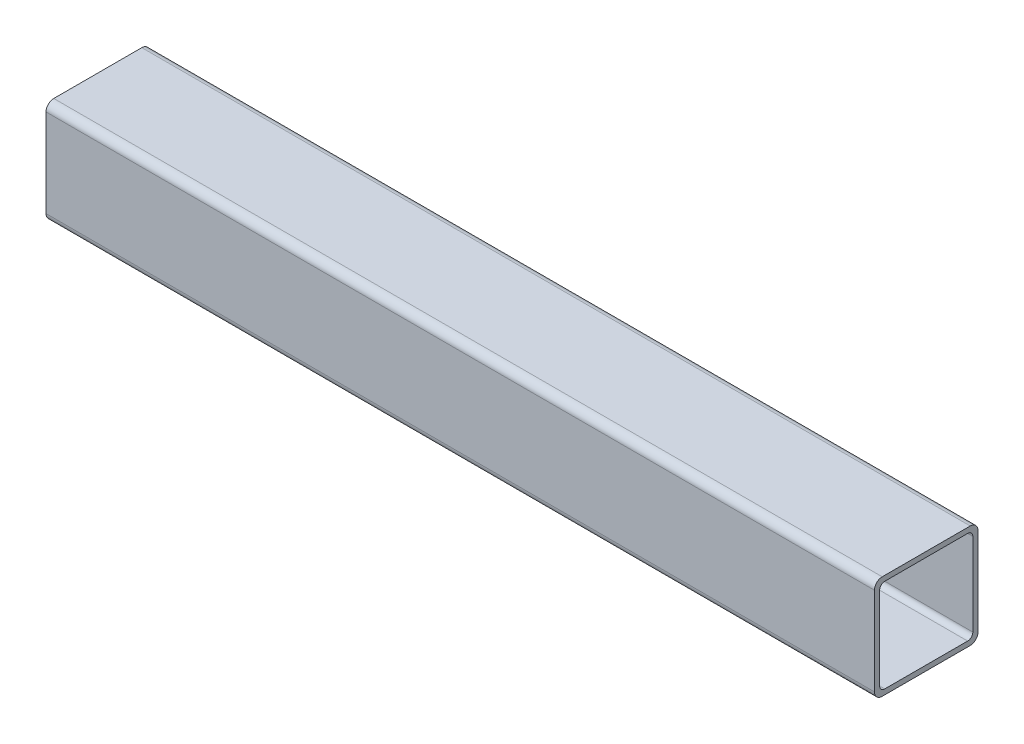
ISO-10303-21;
HEADER;
FILE_DESCRIPTION(('STEP AP214'),'2;1');
FILE_NAME('part.step','',(''),(''),'','','');
FILE_SCHEMA(('AUTOMOTIVE_DESIGN { 1 0 10303 214 1 1 1 1 }'));
ENDSEC;
DATA;
#1=APPLICATION_CONTEXT('core data for automotive mechanical design processes');
#2=APPLICATION_PROTOCOL_DEFINITION('international standard','automotive_design',2000,#1);
#3=PRODUCT_CONTEXT('',#1,'mechanical');
#4=PRODUCT('Part','Part','',(#3));
#5=PRODUCT_RELATED_PRODUCT_CATEGORY('part','',(#4));
#6=PRODUCT_DEFINITION_FORMATION('','',#4);
#7=PRODUCT_DEFINITION_CONTEXT('part definition',#1,'design');
#8=PRODUCT_DEFINITION('design','',#6,#7);
#9=PRODUCT_DEFINITION_SHAPE('','',#8);
#10=(LENGTH_UNIT() NAMED_UNIT(*) SI_UNIT(.MILLI.,.METRE.));
#11=(NAMED_UNIT(*) PLANE_ANGLE_UNIT() SI_UNIT($,.RADIAN.));
#12=(NAMED_UNIT(*) SI_UNIT($,.STERADIAN.) SOLID_ANGLE_UNIT());
#13=UNCERTAINTY_MEASURE_WITH_UNIT(LENGTH_MEASURE(1.E-05),#10,'distance_accuracy_value','');
#14=(GEOMETRIC_REPRESENTATION_CONTEXT(3) GLOBAL_UNCERTAINTY_ASSIGNED_CONTEXT((#13)) GLOBAL_UNIT_ASSIGNED_CONTEXT((#10,
#11,#12)) REPRESENTATION_CONTEXT('',''));
#15=CARTESIAN_POINT('',(0.,0.,0.));
#16=DIRECTION('',(0.,0.,1.));
#17=DIRECTION('',(1.,0.,0.));
#18=AXIS2_PLACEMENT_3D('',#15,#16,#17);
#19=CARTESIAN_POINT('',(-320.,-17.,17.));
#20=DIRECTION('',(1.,0.,0.));
#21=DIRECTION('',(0.,0.,-1.));
#22=AXIS2_PLACEMENT_3D('',#19,#20,#21);
#23=CYLINDRICAL_SURFACE('',#22,3.);
#24=CARTESIAN_POINT('',(0.,-17.,17.));
#25=DIRECTION('',(1.,0.,0.));
#26=DIRECTION('',(0.,0.,-1.));
#27=AXIS2_PLACEMENT_3D('',#24,#25,#26);
#28=CIRCLE('',#27,3.);
#29=CARTESIAN_POINT('',(0.,-17.,20.));
#30=VERTEX_POINT('',#29);
#31=CARTESIAN_POINT('',(0.,-20.,17.));
#32=VERTEX_POINT('',#31);
#33=EDGE_CURVE('E206',#30,#32,#28,.T.);
#34=ORIENTED_EDGE('',*,*,#33,.F.);
#35=DIRECTION('',(1.,0.,0.));
#36=VECTOR('',#35,1.);
#37=CARTESIAN_POINT('',(-320.,-17.,20.));
#38=LINE('',#37,#36);
#39=CARTESIAN_POINT('',(-320.,-17.,20.));
#40=VERTEX_POINT('',#39);
#41=EDGE_CURVE('E11',#40,#30,#38,.T.);
#42=ORIENTED_EDGE('',*,*,#41,.F.);
#43=CARTESIAN_POINT('',(-320.,-17.,17.));
#44=DIRECTION('',(1.,0.,0.));
#45=DIRECTION('',(0.,0.,-1.));
#46=AXIS2_PLACEMENT_3D('',#43,#44,#45);
#47=CIRCLE('',#46,3.);
#48=CARTESIAN_POINT('',(-320.,-20.,17.));
#49=VERTEX_POINT('',#48);
#50=EDGE_CURVE('E218',#40,#49,#47,.T.);
#51=ORIENTED_EDGE('',*,*,#50,.T.);
#52=DIRECTION('',(1.,0.,0.));
#53=VECTOR('',#52,1.);
#54=CARTESIAN_POINT('',(-320.,-20.,17.));
#55=LINE('',#54,#53);
#56=EDGE_CURVE('E39',#49,#32,#55,.T.);
#57=ORIENTED_EDGE('',*,*,#56,.T.);
#58=EDGE_LOOP('',(#34,#42,#51,#57));
#59=FACE_BOUND('',#58,.T.);
#60=ADVANCED_FACE('F36',(#59),#23,.T.);
#61=CARTESIAN_POINT('',(-320.,17.,20.));
#62=DIRECTION('',(0.,0.,1.));
#63=DIRECTION('',(1.,0.,0.));
#64=AXIS2_PLACEMENT_3D('',#61,#62,#63);
#65=PLANE('',#64);
#66=DIRECTION('',(0.,-1.,0.));
#67=VECTOR('',#66,1.);
#68=CARTESIAN_POINT('',(0.,17.,20.));
#69=LINE('',#68,#67);
#70=CARTESIAN_POINT('',(0.,17.,20.));
#71=VERTEX_POINT('',#70);
#72=EDGE_CURVE('E222',#71,#30,#69,.T.);
#73=ORIENTED_EDGE('',*,*,#72,.F.);
#74=DIRECTION('',(1.,0.,0.));
#75=VECTOR('',#74,1.);
#76=CARTESIAN_POINT('',(-320.,17.,20.));
#77=LINE('',#76,#75);
#78=CARTESIAN_POINT('',(-320.,17.,20.));
#79=VERTEX_POINT('',#78);
#80=EDGE_CURVE('E44',#79,#71,#77,.T.);
#81=ORIENTED_EDGE('',*,*,#80,.F.);
#82=DIRECTION('',(0.,-1.,0.));
#83=VECTOR('',#82,1.);
#84=CARTESIAN_POINT('',(-320.,17.,20.));
#85=LINE('',#84,#83);
#86=EDGE_CURVE('E240',#79,#40,#85,.T.);
#87=ORIENTED_EDGE('',*,*,#86,.T.);
#88=ORIENTED_EDGE('',*,*,#41,.T.);
#89=EDGE_LOOP('',(#73,#81,#87,#88));
#90=FACE_BOUND('',#89,.T.);
#91=ADVANCED_FACE('F287',(#90),#65,.T.);
#92=CARTESIAN_POINT('',(-320.,17.,17.));
#93=DIRECTION('',(1.,0.,0.));
#94=DIRECTION('',(0.,0.,-1.));
#95=AXIS2_PLACEMENT_3D('',#92,#93,#94);
#96=CYLINDRICAL_SURFACE('',#95,3.);
#97=CARTESIAN_POINT('',(0.,17.,17.));
#98=DIRECTION('',(1.,0.,0.));
#99=DIRECTION('',(0.,0.,-1.));
#100=AXIS2_PLACEMENT_3D('',#97,#98,#99);
#101=CIRCLE('',#100,3.);
#102=CARTESIAN_POINT('',(0.,20.,17.));
#103=VERTEX_POINT('',#102);
#104=EDGE_CURVE('E260',#103,#71,#101,.T.);
#105=ORIENTED_EDGE('',*,*,#104,.F.);
#106=DIRECTION('',(1.,0.,0.));
#107=VECTOR('',#106,1.);
#108=CARTESIAN_POINT('',(-320.,20.,17.));
#109=LINE('',#108,#107);
#110=CARTESIAN_POINT('',(-320.,20.,17.));
#111=VERTEX_POINT('',#110);
#112=EDGE_CURVE('E266',#111,#103,#109,.T.);
#113=ORIENTED_EDGE('',*,*,#112,.F.);
#114=CARTESIAN_POINT('',(-320.,17.,17.));
#115=DIRECTION('',(1.,0.,0.));
#116=DIRECTION('',(0.,0.,-1.));
#117=AXIS2_PLACEMENT_3D('',#114,#115,#116);
#118=CIRCLE('',#117,3.);
#119=EDGE_CURVE('E237',#111,#79,#118,.T.);
#120=ORIENTED_EDGE('',*,*,#119,.T.);
#121=ORIENTED_EDGE('',*,*,#80,.T.);
#122=EDGE_LOOP('',(#105,#113,#120,#121));
#123=FACE_BOUND('',#122,.T.);
#124=ADVANCED_FACE('F306',(#123),#96,.T.);
#125=CARTESIAN_POINT('',(-320.,20.,17.));
#126=DIRECTION('',(0.,1.,0.));
#127=DIRECTION('',(0.,0.,1.));
#128=AXIS2_PLACEMENT_3D('',#125,#126,#127);
#129=PLANE('',#128);
#130=DIRECTION('',(0.,0.,1.));
#131=VECTOR('',#130,1.);
#132=CARTESIAN_POINT('',(0.,20.,17.));
#133=LINE('',#132,#131);
#134=CARTESIAN_POINT('',(0.,20.,-17.));
#135=VERTEX_POINT('',#134);
#136=EDGE_CURVE('E257',#135,#103,#133,.T.);
#137=ORIENTED_EDGE('',*,*,#136,.F.);
#138=DIRECTION('',(1.,0.,0.));
#139=VECTOR('',#138,1.);
#140=CARTESIAN_POINT('',(-320.,20.,-17.));
#141=LINE('',#140,#139);
#142=CARTESIAN_POINT('',(-320.,20.,-17.));
#143=VERTEX_POINT('',#142);
#144=EDGE_CURVE('E268',#143,#135,#141,.T.);
#145=ORIENTED_EDGE('',*,*,#144,.F.);
#146=DIRECTION('',(0.,0.,1.));
#147=VECTOR('',#146,1.);
#148=CARTESIAN_POINT('',(-320.,20.,17.));
#149=LINE('',#148,#147);
#150=EDGE_CURVE('E234',#143,#111,#149,.T.);
#151=ORIENTED_EDGE('',*,*,#150,.T.);
#152=ORIENTED_EDGE('',*,*,#112,.T.);
#153=EDGE_LOOP('',(#137,#145,#151,#152));
#154=FACE_BOUND('',#153,.T.);
#155=ADVANCED_FACE('F304',(#154),#129,.T.);
#156=CARTESIAN_POINT('',(-320.,17.,-17.));
#157=DIRECTION('',(1.,0.,0.));
#158=DIRECTION('',(0.,0.,-1.));
#159=AXIS2_PLACEMENT_3D('',#156,#157,#158);
#160=CYLINDRICAL_SURFACE('',#159,3.);
#161=CARTESIAN_POINT('',(0.,17.,-17.));
#162=DIRECTION('',(1.,0.,0.));
#163=DIRECTION('',(0.,0.,1.));
#164=AXIS2_PLACEMENT_3D('',#161,#162,#163);
#165=CIRCLE('',#164,3.);
#166=CARTESIAN_POINT('',(0.,17.,-20.));
#167=VERTEX_POINT('',#166);
#168=EDGE_CURVE('E254',#167,#135,#165,.T.);
#169=ORIENTED_EDGE('',*,*,#168,.F.);
#170=DIRECTION('',(1.,0.,0.));
#171=VECTOR('',#170,1.);
#172=CARTESIAN_POINT('',(-320.,17.,-20.));
#173=LINE('',#172,#171);
#174=CARTESIAN_POINT('',(-320.,17.,-20.));
#175=VERTEX_POINT('',#174);
#176=EDGE_CURVE('E270',#175,#167,#173,.T.);
#177=ORIENTED_EDGE('',*,*,#176,.F.);
#178=CARTESIAN_POINT('',(-320.,17.,-17.));
#179=DIRECTION('',(1.,0.,0.));
#180=DIRECTION('',(0.,0.,1.));
#181=AXIS2_PLACEMENT_3D('',#178,#179,#180);
#182=CIRCLE('',#181,3.);
#183=EDGE_CURVE('E231',#175,#143,#182,.T.);
#184=ORIENTED_EDGE('',*,*,#183,.T.);
#185=ORIENTED_EDGE('',*,*,#144,.T.);
#186=EDGE_LOOP('',(#169,#177,#184,#185));
#187=FACE_BOUND('',#186,.T.);
#188=ADVANCED_FACE('F300',(#187),#160,.T.);
#189=CARTESIAN_POINT('',(-320.,17.,-20.));
#190=DIRECTION('',(0.,0.,-1.));
#191=DIRECTION('',(0.,1.,0.));
#192=AXIS2_PLACEMENT_3D('',#189,#190,#191);
#193=PLANE('',#192);
#194=DIRECTION('',(0.,1.,0.));
#195=VECTOR('',#194,1.);
#196=CARTESIAN_POINT('',(0.,17.,-20.));
#197=LINE('',#196,#195);
#198=CARTESIAN_POINT('',(0.,-17.,-20.));
#199=VERTEX_POINT('',#198);
#200=EDGE_CURVE('E251',#199,#167,#197,.T.);
#201=ORIENTED_EDGE('',*,*,#200,.F.);
#202=DIRECTION('',(1.,0.,0.));
#203=VECTOR('',#202,1.);
#204=CARTESIAN_POINT('',(-320.,-17.,-20.));
#205=LINE('',#204,#203);
#206=CARTESIAN_POINT('',(-320.,-17.,-20.));
#207=VERTEX_POINT('',#206);
#208=EDGE_CURVE('E272',#207,#199,#205,.T.);
#209=ORIENTED_EDGE('',*,*,#208,.F.);
#210=DIRECTION('',(0.,1.,0.));
#211=VECTOR('',#210,1.);
#212=CARTESIAN_POINT('',(-320.,17.,-20.));
#213=LINE('',#212,#211);
#214=EDGE_CURVE('E228',#207,#175,#213,.T.);
#215=ORIENTED_EDGE('',*,*,#214,.T.);
#216=ORIENTED_EDGE('',*,*,#176,.T.);
#217=EDGE_LOOP('',(#201,#209,#215,#216));
#218=FACE_BOUND('',#217,.T.);
#219=ADVANCED_FACE('F298',(#218),#193,.T.);
#220=CARTESIAN_POINT('',(-320.,-17.,-17.));
#221=DIRECTION('',(1.,0.,0.));
#222=DIRECTION('',(0.,0.,-1.));
#223=AXIS2_PLACEMENT_3D('',#220,#221,#222);
#224=CYLINDRICAL_SURFACE('',#223,3.);
#225=CARTESIAN_POINT('',(0.,-17.,-17.));
#226=DIRECTION('',(1.,0.,0.));
#227=DIRECTION('',(0.,0.,-1.));
#228=AXIS2_PLACEMENT_3D('',#225,#226,#227);
#229=CIRCLE('',#228,3.);
#230=CARTESIAN_POINT('',(0.,-20.,-17.));
#231=VERTEX_POINT('',#230);
#232=EDGE_CURVE('E248',#231,#199,#229,.T.);
#233=ORIENTED_EDGE('',*,*,#232,.F.);
#234=DIRECTION('',(1.,0.,0.));
#235=VECTOR('',#234,1.);
#236=CARTESIAN_POINT('',(-320.,-20.,-17.));
#237=LINE('',#236,#235);
#238=CARTESIAN_POINT('',(-320.,-20.,-17.));
#239=VERTEX_POINT('',#238);
#240=EDGE_CURVE('E273',#239,#231,#237,.T.);
#241=ORIENTED_EDGE('',*,*,#240,.F.);
#242=CARTESIAN_POINT('',(-320.,-17.,-17.));
#243=DIRECTION('',(1.,0.,0.));
#244=DIRECTION('',(0.,0.,-1.));
#245=AXIS2_PLACEMENT_3D('',#242,#243,#244);
#246=CIRCLE('',#245,3.);
#247=EDGE_CURVE('E225',#239,#207,#246,.T.);
#248=ORIENTED_EDGE('',*,*,#247,.T.);
#249=ORIENTED_EDGE('',*,*,#208,.T.);
#250=EDGE_LOOP('',(#233,#241,#248,#249));
#251=FACE_BOUND('',#250,.T.);
#252=ADVANCED_FACE('F294',(#251),#224,.T.);
#253=CARTESIAN_POINT('',(-320.,-20.,17.));
#254=DIRECTION('',(0.,-1.,0.));
#255=DIRECTION('',(0.,0.,-1.));
#256=AXIS2_PLACEMENT_3D('',#253,#254,#255);
#257=PLANE('',#256);
#258=DIRECTION('',(0.,0.,-1.));
#259=VECTOR('',#258,1.);
#260=CARTESIAN_POINT('',(0.,-20.,17.));
#261=LINE('',#260,#259);
#262=EDGE_CURVE('E245',#32,#231,#261,.T.);
#263=ORIENTED_EDGE('',*,*,#262,.F.);
#264=ORIENTED_EDGE('',*,*,#56,.F.);
#265=DIRECTION('',(0.,0.,-1.));
#266=VECTOR('',#265,1.);
#267=CARTESIAN_POINT('',(-320.,-20.,17.));
#268=LINE('',#267,#266);
#269=EDGE_CURVE('E221',#49,#239,#268,.T.);
#270=ORIENTED_EDGE('',*,*,#269,.T.);
#271=ORIENTED_EDGE('',*,*,#240,.T.);
#272=EDGE_LOOP('',(#263,#264,#270,#271));
#273=FACE_BOUND('',#272,.T.);
#274=ADVANCED_FACE('F281',(#273),#257,.T.);
#275=CARTESIAN_POINT('',(-320.,-17.,17.));
#276=DIRECTION('',(1.,0.,0.));
#277=DIRECTION('',(0.,0.,-1.));
#278=AXIS2_PLACEMENT_3D('',#275,#276,#277);
#279=PLANE('',#278);
#280=DIRECTION('',(0.,-1.,0.));
#281=VECTOR('',#280,1.);
#282=CARTESIAN_POINT('',(-320.,16.,18.));
#283=LINE('',#282,#281);
#284=CARTESIAN_POINT('',(-320.,16.,18.));
#285=VERTEX_POINT('',#284);
#286=CARTESIAN_POINT('',(-320.,-16.,18.));
#287=VERTEX_POINT('',#286);
#288=EDGE_CURVE('E157',#285,#287,#283,.T.);
#289=ORIENTED_EDGE('',*,*,#288,.T.);
#290=CARTESIAN_POINT('',(-320.,-16.,16.));
#291=DIRECTION('',(1.,0.,0.));
#292=DIRECTION('',(0.,0.,-1.));
#293=AXIS2_PLACEMENT_3D('',#290,#291,#292);
#294=CIRCLE('',#293,2.);
#295=CARTESIAN_POINT('',(-320.,-18.,16.));
#296=VERTEX_POINT('',#295);
#297=EDGE_CURVE('E151',#287,#296,#294,.T.);
#298=ORIENTED_EDGE('',*,*,#297,.T.);
#299=DIRECTION('',(0.,0.,-1.));
#300=VECTOR('',#299,1.);
#301=CARTESIAN_POINT('',(-320.,-18.,16.));
#302=LINE('',#301,#300);
#303=CARTESIAN_POINT('',(-320.,-18.,-16.));
#304=VERTEX_POINT('',#303);
#305=EDGE_CURVE('E160',#296,#304,#302,.T.);
#306=ORIENTED_EDGE('',*,*,#305,.T.);
#307=CARTESIAN_POINT('',(-320.,-16.,-16.));
#308=DIRECTION('',(1.,0.,0.));
#309=DIRECTION('',(0.,0.,-1.));
#310=AXIS2_PLACEMENT_3D('',#307,#308,#309);
#311=CIRCLE('',#310,2.);
#312=CARTESIAN_POINT('',(-320.,-16.,-18.));
#313=VERTEX_POINT('',#312);
#314=EDGE_CURVE('E52',#304,#313,#311,.T.);
#315=ORIENTED_EDGE('',*,*,#314,.T.);
#316=DIRECTION('',(0.,1.,0.));
#317=VECTOR('',#316,1.);
#318=CARTESIAN_POINT('',(-320.,16.,-18.));
#319=LINE('',#318,#317);
#320=CARTESIAN_POINT('',(-320.,16.,-18.));
#321=VERTEX_POINT('',#320);
#322=EDGE_CURVE('E175',#313,#321,#319,.T.);
#323=ORIENTED_EDGE('',*,*,#322,.T.);
#324=CARTESIAN_POINT('',(-320.,16.,-16.));
#325=DIRECTION('',(1.,0.,0.));
#326=DIRECTION('',(0.,0.,1.));
#327=AXIS2_PLACEMENT_3D('',#324,#325,#326);
#328=CIRCLE('',#327,2.);
#329=CARTESIAN_POINT('',(-320.,18.,-16.));
#330=VERTEX_POINT('',#329);
#331=EDGE_CURVE('E178',#321,#330,#328,.T.);
#332=ORIENTED_EDGE('',*,*,#331,.T.);
#333=DIRECTION('',(0.,0.,1.));
#334=VECTOR('',#333,1.);
#335=CARTESIAN_POINT('',(-320.,18.,16.));
#336=LINE('',#335,#334);
#337=CARTESIAN_POINT('',(-320.,18.,16.));
#338=VERTEX_POINT('',#337);
#339=EDGE_CURVE('E181',#330,#338,#336,.T.);
#340=ORIENTED_EDGE('',*,*,#339,.T.);
#341=CARTESIAN_POINT('',(-320.,16.,16.));
#342=DIRECTION('',(1.,0.,0.));
#343=DIRECTION('',(0.,0.,-1.));
#344=AXIS2_PLACEMENT_3D('',#341,#342,#343);
#345=CIRCLE('',#344,2.);
#346=EDGE_CURVE('E184',#338,#285,#345,.T.);
#347=ORIENTED_EDGE('',*,*,#346,.T.);
#348=EDGE_LOOP('',(#289,#298,#306,#315,#323,#332,#340,#347));
#349=FACE_BOUND('',#348,.T.);
#350=ORIENTED_EDGE('',*,*,#50,.F.);
#351=ORIENTED_EDGE('',*,*,#86,.F.);
#352=ORIENTED_EDGE('',*,*,#119,.F.);
#353=ORIENTED_EDGE('',*,*,#150,.F.);
#354=ORIENTED_EDGE('',*,*,#183,.F.);
#355=ORIENTED_EDGE('',*,*,#214,.F.);
#356=ORIENTED_EDGE('',*,*,#247,.F.);
#357=ORIENTED_EDGE('',*,*,#269,.F.);
#358=EDGE_LOOP('',(#350,#351,#352,#353,#354,#355,#356,#357));
#359=FACE_BOUND('',#358,.T.);
#360=ADVANCED_FACE('F164',(#349,#359),#279,.F.);
#361=CARTESIAN_POINT('',(0.,-17.,17.));
#362=DIRECTION('',(1.,0.,0.));
#363=DIRECTION('',(0.,0.,-1.));
#364=AXIS2_PLACEMENT_3D('',#361,#362,#363);
#365=PLANE('',#364);
#366=CARTESIAN_POINT('',(0.,-16.,16.));
#367=DIRECTION('',(1.,0.,0.));
#368=DIRECTION('',(0.,0.,-1.));
#369=AXIS2_PLACEMENT_3D('',#366,#367,#368);
#370=CIRCLE('',#369,2.);
#371=CARTESIAN_POINT('',(0.,-16.,18.));
#372=VERTEX_POINT('',#371);
#373=CARTESIAN_POINT('',(0.,-18.,16.));
#374=VERTEX_POINT('',#373);
#375=EDGE_CURVE('E60',#372,#374,#370,.T.);
#376=ORIENTED_EDGE('',*,*,#375,.F.);
#377=DIRECTION('',(0.,-1.,0.));
#378=VECTOR('',#377,1.);
#379=CARTESIAN_POINT('',(0.,16.,18.));
#380=LINE('',#379,#378);
#381=CARTESIAN_POINT('',(0.,16.,18.));
#382=VERTEX_POINT('',#381);
#383=EDGE_CURVE('E168',#382,#372,#380,.T.);
#384=ORIENTED_EDGE('',*,*,#383,.F.);
#385=CARTESIAN_POINT('',(0.,16.,16.));
#386=DIRECTION('',(1.,0.,0.));
#387=DIRECTION('',(0.,0.,-1.));
#388=AXIS2_PLACEMENT_3D('',#385,#386,#387);
#389=CIRCLE('',#388,2.);
#390=CARTESIAN_POINT('',(0.,18.,16.));
#391=VERTEX_POINT('',#390);
#392=EDGE_CURVE('E171',#391,#382,#389,.T.);
#393=ORIENTED_EDGE('',*,*,#392,.F.);
#394=DIRECTION('',(0.,0.,1.));
#395=VECTOR('',#394,1.);
#396=CARTESIAN_POINT('',(0.,18.,16.));
#397=LINE('',#396,#395);
#398=CARTESIAN_POINT('',(0.,18.,-16.));
#399=VERTEX_POINT('',#398);
#400=EDGE_CURVE('E199',#399,#391,#397,.T.);
#401=ORIENTED_EDGE('',*,*,#400,.F.);
#402=CARTESIAN_POINT('',(0.,16.,-16.));
#403=DIRECTION('',(1.,0.,0.));
#404=DIRECTION('',(0.,0.,1.));
#405=AXIS2_PLACEMENT_3D('',#402,#403,#404);
#406=CIRCLE('',#405,2.);
#407=CARTESIAN_POINT('',(0.,16.,-18.));
#408=VERTEX_POINT('',#407);
#409=EDGE_CURVE('E196',#408,#399,#406,.T.);
#410=ORIENTED_EDGE('',*,*,#409,.F.);
#411=DIRECTION('',(0.,1.,0.));
#412=VECTOR('',#411,1.);
#413=CARTESIAN_POINT('',(0.,16.,-18.));
#414=LINE('',#413,#412);
#415=CARTESIAN_POINT('',(0.,-16.,-18.));
#416=VERTEX_POINT('',#415);
#417=EDGE_CURVE('E193',#416,#408,#414,.T.);
#418=ORIENTED_EDGE('',*,*,#417,.F.);
#419=CARTESIAN_POINT('',(0.,-16.,-16.));
#420=DIRECTION('',(1.,0.,0.));
#421=DIRECTION('',(0.,0.,-1.));
#422=AXIS2_PLACEMENT_3D('',#419,#420,#421);
#423=CIRCLE('',#422,2.);
#424=CARTESIAN_POINT('',(0.,-18.,-16.));
#425=VERTEX_POINT('',#424);
#426=EDGE_CURVE('E190',#425,#416,#423,.T.);
#427=ORIENTED_EDGE('',*,*,#426,.F.);
#428=DIRECTION('',(0.,0.,-1.));
#429=VECTOR('',#428,1.);
#430=CARTESIAN_POINT('',(0.,-18.,16.));
#431=LINE('',#430,#429);
#432=EDGE_CURVE('E188',#374,#425,#431,.T.);
#433=ORIENTED_EDGE('',*,*,#432,.F.);
#434=EDGE_LOOP('',(#376,#384,#393,#401,#410,#418,#427,#433));
#435=FACE_BOUND('',#434,.T.);
#436=ORIENTED_EDGE('',*,*,#33,.T.);
#437=ORIENTED_EDGE('',*,*,#262,.T.);
#438=ORIENTED_EDGE('',*,*,#232,.T.);
#439=ORIENTED_EDGE('',*,*,#200,.T.);
#440=ORIENTED_EDGE('',*,*,#168,.T.);
#441=ORIENTED_EDGE('',*,*,#136,.T.);
#442=ORIENTED_EDGE('',*,*,#104,.T.);
#443=ORIENTED_EDGE('',*,*,#72,.T.);
#444=EDGE_LOOP('',(#436,#437,#438,#439,#440,#441,#442,#443));
#445=FACE_BOUND('',#444,.T.);
#446=ADVANCED_FACE('F283',(#435,#445),#365,.T.);
#447=CARTESIAN_POINT('',(-320.,-16.,16.));
#448=DIRECTION('',(1.,0.,0.));
#449=DIRECTION('',(0.,0.,-1.));
#450=AXIS2_PLACEMENT_3D('',#447,#448,#449);
#451=CYLINDRICAL_SURFACE('',#450,2.);
#452=ORIENTED_EDGE('',*,*,#375,.T.);
#453=DIRECTION('',(1.,0.,0.));
#454=VECTOR('',#453,1.);
#455=CARTESIAN_POINT('',(-320.,-18.,16.));
#456=LINE('',#455,#454);
#457=EDGE_CURVE('E147',#296,#374,#456,.T.);
#458=ORIENTED_EDGE('',*,*,#457,.F.);
#459=ORIENTED_EDGE('',*,*,#297,.F.);
#460=DIRECTION('',(1.,0.,0.));
#461=VECTOR('',#460,1.);
#462=CARTESIAN_POINT('',(-320.,-16.,18.));
#463=LINE('',#462,#461);
#464=EDGE_CURVE('E204',#287,#372,#463,.T.);
#465=ORIENTED_EDGE('',*,*,#464,.T.);
#466=EDGE_LOOP('',(#452,#458,#459,#465));
#467=FACE_BOUND('',#466,.T.);
#468=ADVANCED_FACE('F149',(#467),#451,.F.);
#469=CARTESIAN_POINT('',(-320.,16.,18.));
#470=DIRECTION('',(0.,0.,1.));
#471=DIRECTION('',(1.,0.,0.));
#472=AXIS2_PLACEMENT_3D('',#469,#470,#471);
#473=PLANE('',#472);
#474=ORIENTED_EDGE('',*,*,#383,.T.);
#475=ORIENTED_EDGE('',*,*,#464,.F.);
#476=ORIENTED_EDGE('',*,*,#288,.F.);
#477=DIRECTION('',(1.,0.,0.));
#478=VECTOR('',#477,1.);
#479=CARTESIAN_POINT('',(-320.,16.,18.));
#480=LINE('',#479,#478);
#481=EDGE_CURVE('E207',#285,#382,#480,.T.);
#482=ORIENTED_EDGE('',*,*,#481,.T.);
#483=EDGE_LOOP('',(#474,#475,#476,#482));
#484=FACE_BOUND('',#483,.T.);
#485=ADVANCED_FACE('F389',(#484),#473,.F.);
#486=CARTESIAN_POINT('',(-320.,16.,16.));
#487=DIRECTION('',(1.,0.,0.));
#488=DIRECTION('',(0.,0.,-1.));
#489=AXIS2_PLACEMENT_3D('',#486,#487,#488);
#490=CYLINDRICAL_SURFACE('',#489,2.);
#491=ORIENTED_EDGE('',*,*,#392,.T.);
#492=ORIENTED_EDGE('',*,*,#481,.F.);
#493=ORIENTED_EDGE('',*,*,#346,.F.);
#494=DIRECTION('',(1.,0.,0.));
#495=VECTOR('',#494,1.);
#496=CARTESIAN_POINT('',(-320.,18.,16.));
#497=LINE('',#496,#495);
#498=EDGE_CURVE('E209',#338,#391,#497,.T.);
#499=ORIENTED_EDGE('',*,*,#498,.T.);
#500=EDGE_LOOP('',(#491,#492,#493,#499));
#501=FACE_BOUND('',#500,.T.);
#502=ADVANCED_FACE('F398',(#501),#490,.F.);
#503=CARTESIAN_POINT('',(-320.,18.,16.));
#504=DIRECTION('',(0.,1.,0.));
#505=DIRECTION('',(0.,0.,1.));
#506=AXIS2_PLACEMENT_3D('',#503,#504,#505);
#507=PLANE('',#506);
#508=ORIENTED_EDGE('',*,*,#400,.T.);
#509=ORIENTED_EDGE('',*,*,#498,.F.);
#510=ORIENTED_EDGE('',*,*,#339,.F.);
#511=DIRECTION('',(1.,0.,0.));
#512=VECTOR('',#511,1.);
#513=CARTESIAN_POINT('',(-320.,18.,-16.));
#514=LINE('',#513,#512);
#515=EDGE_CURVE('E211',#330,#399,#514,.T.);
#516=ORIENTED_EDGE('',*,*,#515,.T.);
#517=EDGE_LOOP('',(#508,#509,#510,#516));
#518=FACE_BOUND('',#517,.T.);
#519=ADVANCED_FACE('F408',(#518),#507,.F.);
#520=CARTESIAN_POINT('',(-320.,16.,-16.));
#521=DIRECTION('',(1.,0.,0.));
#522=DIRECTION('',(0.,0.,-1.));
#523=AXIS2_PLACEMENT_3D('',#520,#521,#522);
#524=CYLINDRICAL_SURFACE('',#523,2.);
#525=ORIENTED_EDGE('',*,*,#409,.T.);
#526=ORIENTED_EDGE('',*,*,#515,.F.);
#527=ORIENTED_EDGE('',*,*,#331,.F.);
#528=DIRECTION('',(1.,0.,0.));
#529=VECTOR('',#528,1.);
#530=CARTESIAN_POINT('',(-320.,16.,-18.));
#531=LINE('',#530,#529);
#532=EDGE_CURVE('E213',#321,#408,#531,.T.);
#533=ORIENTED_EDGE('',*,*,#532,.T.);
#534=EDGE_LOOP('',(#525,#526,#527,#533));
#535=FACE_BOUND('',#534,.T.);
#536=ADVANCED_FACE('F418',(#535),#524,.F.);
#537=CARTESIAN_POINT('',(-320.,16.,-18.));
#538=DIRECTION('',(0.,0.,-1.));
#539=DIRECTION('',(-1.,0.,0.));
#540=AXIS2_PLACEMENT_3D('',#537,#538,#539);
#541=PLANE('',#540);
#542=ORIENTED_EDGE('',*,*,#417,.T.);
#543=ORIENTED_EDGE('',*,*,#532,.F.);
#544=ORIENTED_EDGE('',*,*,#322,.F.);
#545=DIRECTION('',(1.,0.,0.));
#546=VECTOR('',#545,1.);
#547=CARTESIAN_POINT('',(-320.,-16.,-18.));
#548=LINE('',#547,#546);
#549=EDGE_CURVE('E215',#313,#416,#548,.T.);
#550=ORIENTED_EDGE('',*,*,#549,.T.);
#551=EDGE_LOOP('',(#542,#543,#544,#550));
#552=FACE_BOUND('',#551,.T.);
#553=ADVANCED_FACE('F428',(#552),#541,.F.);
#554=CARTESIAN_POINT('',(-320.,-16.,-16.));
#555=DIRECTION('',(1.,0.,0.));
#556=DIRECTION('',(0.,0.,-1.));
#557=AXIS2_PLACEMENT_3D('',#554,#555,#556);
#558=CYLINDRICAL_SURFACE('',#557,2.);
#559=ORIENTED_EDGE('',*,*,#426,.T.);
#560=ORIENTED_EDGE('',*,*,#549,.F.);
#561=ORIENTED_EDGE('',*,*,#314,.F.);
#562=DIRECTION('',(1.,0.,0.));
#563=VECTOR('',#562,1.);
#564=CARTESIAN_POINT('',(-320.,-18.,-16.));
#565=LINE('',#564,#563);
#566=EDGE_CURVE('E156',#304,#425,#565,.T.);
#567=ORIENTED_EDGE('',*,*,#566,.T.);
#568=EDGE_LOOP('',(#559,#560,#561,#567));
#569=FACE_BOUND('',#568,.T.);
#570=ADVANCED_FACE('F438',(#569),#558,.F.);
#571=CARTESIAN_POINT('',(-320.,-18.,16.));
#572=DIRECTION('',(0.,-1.,0.));
#573=DIRECTION('',(0.,0.,-1.));
#574=AXIS2_PLACEMENT_3D('',#571,#572,#573);
#575=PLANE('',#574);
#576=ORIENTED_EDGE('',*,*,#432,.T.);
#577=ORIENTED_EDGE('',*,*,#566,.F.);
#578=ORIENTED_EDGE('',*,*,#305,.F.);
#579=ORIENTED_EDGE('',*,*,#457,.T.);
#580=EDGE_LOOP('',(#576,#577,#578,#579));
#581=FACE_BOUND('',#580,.T.);
#582=ADVANCED_FACE('F161',(#581),#575,.F.);
#583=CLOSED_SHELL('',(#60,#91,#124,#155,#188,#219,#252,#274,#360,#446,#468,#485,#502,#519,#536,
#553,#570,#582));
#584=MANIFOLD_SOLID_BREP('B2',#583);
#585=ADVANCED_BREP_SHAPE_REPRESENTATION('',(#18,#584),#14);
#586=SHAPE_DEFINITION_REPRESENTATION(#9,#585);
ENDSEC;
END-ISO-10303-21;
